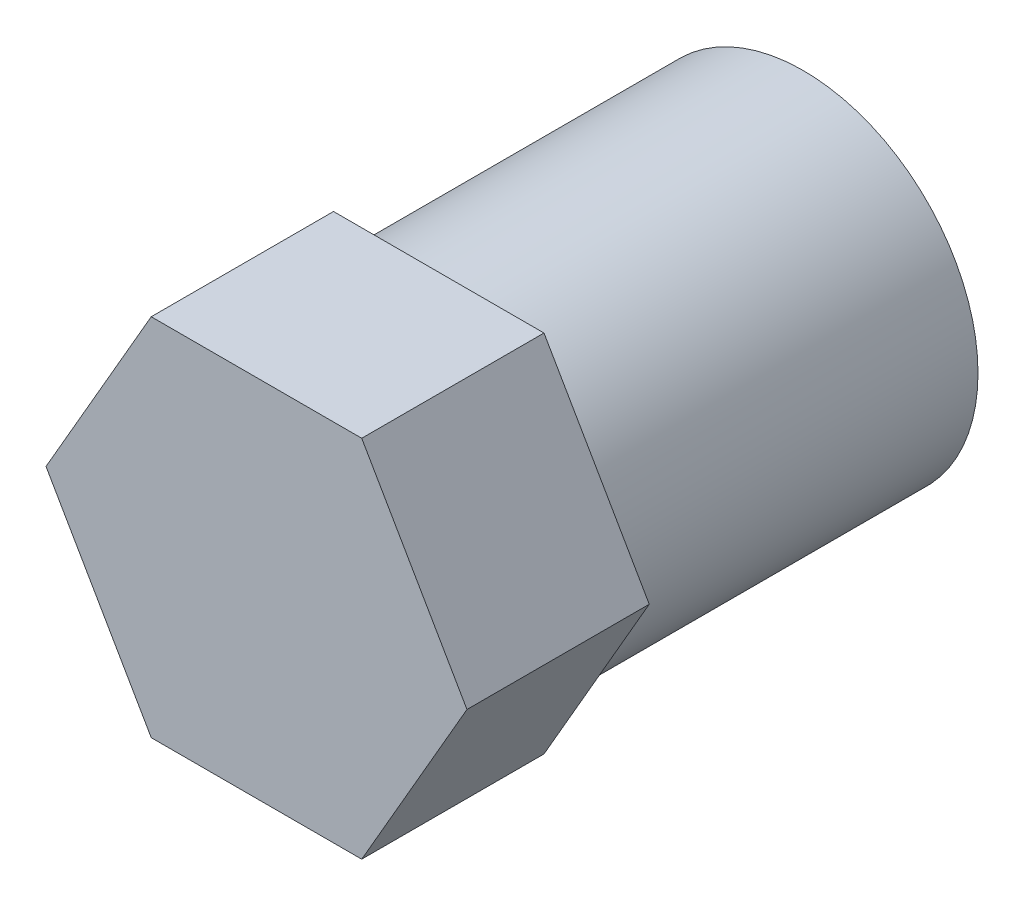
ISO-10303-21;
HEADER;
FILE_DESCRIPTION(('STEP AP214'),'2;1');
FILE_NAME('part.step','',(''),(''),'','','');
FILE_SCHEMA(('AUTOMOTIVE_DESIGN { 1 0 10303 214 1 1 1 1 }'));
ENDSEC;
DATA;
#1=APPLICATION_CONTEXT('core data for automotive mechanical design processes');
#2=APPLICATION_PROTOCOL_DEFINITION('international standard','automotive_design',2000,#1);
#3=PRODUCT_CONTEXT('',#1,'mechanical');
#4=PRODUCT('Part','Part','',(#3));
#5=PRODUCT_RELATED_PRODUCT_CATEGORY('part','',(#4));
#6=PRODUCT_DEFINITION_FORMATION('','',#4);
#7=PRODUCT_DEFINITION_CONTEXT('part definition',#1,'design');
#8=PRODUCT_DEFINITION('design','',#6,#7);
#9=PRODUCT_DEFINITION_SHAPE('','',#8);
#10=(LENGTH_UNIT() NAMED_UNIT(*) SI_UNIT(.MILLI.,.METRE.));
#11=(NAMED_UNIT(*) PLANE_ANGLE_UNIT() SI_UNIT($,.RADIAN.));
#12=(NAMED_UNIT(*) SI_UNIT($,.STERADIAN.) SOLID_ANGLE_UNIT());
#13=UNCERTAINTY_MEASURE_WITH_UNIT(LENGTH_MEASURE(1.E-05),#10,'distance_accuracy_value','');
#14=(GEOMETRIC_REPRESENTATION_CONTEXT(3) GLOBAL_UNCERTAINTY_ASSIGNED_CONTEXT((#13)) GLOBAL_UNIT_ASSIGNED_CONTEXT((#10,
#11,#12)) REPRESENTATION_CONTEXT('',''));
#15=CARTESIAN_POINT('',(0.,0.,0.));
#16=DIRECTION('',(0.,0.,1.));
#17=DIRECTION('',(1.,0.,0.));
#18=AXIS2_PLACEMENT_3D('',#15,#16,#17);
#19=CARTESIAN_POINT('',(-5.19615242270663,2.99999999999998,6.));
#20=DIRECTION('',(0.86602540378444,-0.499999999999998,0.));
#21=DIRECTION('',(0.499999999999998,0.86602540378444,0.));
#22=AXIS2_PLACEMENT_3D('',#19,#20,#21);
#23=PLANE('',#22);
#24=DIRECTION('',(-0.499999999999998,-0.86602540378444,0.));
#25=VECTOR('',#24,1.);
#26=CARTESIAN_POINT('',(-5.19615242270663,2.99999999999998,0.));
#27=LINE('',#26,#25);
#28=CARTESIAN_POINT('',(-3.46410161513775,6.,0.));
#29=VERTEX_POINT('',#28);
#30=CARTESIAN_POINT('',(-6.92820323027548,0.,0.));
#31=VERTEX_POINT('',#30);
#32=EDGE_CURVE('E125',#29,#31,#27,.T.);
#33=ORIENTED_EDGE('',*,*,#32,.T.);
#34=DIRECTION('',(0.,0.,-1.));
#35=VECTOR('',#34,1.);
#36=CARTESIAN_POINT('',(-6.92820323027548,0.,6.));
#37=LINE('',#36,#35);
#38=CARTESIAN_POINT('',(-6.92820323027548,0.,6.));
#39=VERTEX_POINT('',#38);
#40=EDGE_CURVE('E48',#39,#31,#37,.T.);
#41=ORIENTED_EDGE('',*,*,#40,.F.);
#42=DIRECTION('',(-0.499999999999998,-0.86602540378444,0.));
#43=VECTOR('',#42,1.);
#44=CARTESIAN_POINT('',(-5.19615242270663,2.99999999999998,6.));
#45=LINE('',#44,#43);
#46=CARTESIAN_POINT('',(-3.46410161513775,6.,6.));
#47=VERTEX_POINT('',#46);
#48=EDGE_CURVE('E136',#47,#39,#45,.T.);
#49=ORIENTED_EDGE('',*,*,#48,.F.);
#50=DIRECTION('',(0.,0.,-1.));
#51=VECTOR('',#50,1.);
#52=CARTESIAN_POINT('',(-3.46410161513775,6.,6.));
#53=LINE('',#52,#51);
#54=EDGE_CURVE('E121',#47,#29,#53,.T.);
#55=ORIENTED_EDGE('',*,*,#54,.T.);
#56=EDGE_LOOP('',(#33,#41,#49,#55));
#57=FACE_BOUND('',#56,.T.);
#58=ADVANCED_FACE('F40',(#57),#23,.F.);
#59=CARTESIAN_POINT('',(-5.19615242270663,-2.99999999999998,6.));
#60=DIRECTION('',(0.86602540378444,0.499999999999997,0.));
#61=DIRECTION('',(-0.499999999999997,0.86602540378444,0.));
#62=AXIS2_PLACEMENT_3D('',#59,#60,#61);
#63=PLANE('',#62);
#64=DIRECTION('',(0.499999999999997,-0.86602540378444,0.));
#65=VECTOR('',#64,1.);
#66=CARTESIAN_POINT('',(-5.19615242270663,-2.99999999999998,0.));
#67=LINE('',#66,#65);
#68=CARTESIAN_POINT('',(-3.46410161513775,-6.,0.));
#69=VERTEX_POINT('',#68);
#70=EDGE_CURVE('E128',#31,#69,#67,.T.);
#71=ORIENTED_EDGE('',*,*,#70,.T.);
#72=DIRECTION('',(0.,0.,-1.));
#73=VECTOR('',#72,1.);
#74=CARTESIAN_POINT('',(-3.46410161513775,-6.,6.));
#75=LINE('',#74,#73);
#76=CARTESIAN_POINT('',(-3.46410161513775,-6.,6.));
#77=VERTEX_POINT('',#76);
#78=EDGE_CURVE('E140',#77,#69,#75,.T.);
#79=ORIENTED_EDGE('',*,*,#78,.F.);
#80=DIRECTION('',(0.499999999999997,-0.86602540378444,0.));
#81=VECTOR('',#80,1.);
#82=CARTESIAN_POINT('',(-5.19615242270663,-2.99999999999998,6.));
#83=LINE('',#82,#81);
#84=EDGE_CURVE('E94',#39,#77,#83,.T.);
#85=ORIENTED_EDGE('',*,*,#84,.F.);
#86=ORIENTED_EDGE('',*,*,#40,.T.);
#87=EDGE_LOOP('',(#71,#79,#85,#86));
#88=FACE_BOUND('',#87,.T.);
#89=ADVANCED_FACE('F143',(#88),#63,.F.);
#90=CARTESIAN_POINT('',(0.,-6.,6.));
#91=DIRECTION('',(0.,1.,0.));
#92=DIRECTION('',(-1.,0.,0.));
#93=AXIS2_PLACEMENT_3D('',#90,#91,#92);
#94=PLANE('',#93);
#95=DIRECTION('',(1.,0.,0.));
#96=VECTOR('',#95,1.);
#97=CARTESIAN_POINT('',(0.,-6.,0.));
#98=LINE('',#97,#96);
#99=CARTESIAN_POINT('',(3.46410161513775,-6.,0.));
#100=VERTEX_POINT('',#99);
#101=EDGE_CURVE('E131',#69,#100,#98,.T.);
#102=ORIENTED_EDGE('',*,*,#101,.T.);
#103=DIRECTION('',(0.,0.,-1.));
#104=VECTOR('',#103,1.);
#105=CARTESIAN_POINT('',(3.46410161513775,-6.,6.));
#106=LINE('',#105,#104);
#107=CARTESIAN_POINT('',(3.46410161513775,-6.,6.));
#108=VERTEX_POINT('',#107);
#109=EDGE_CURVE('E116',#108,#100,#106,.T.);
#110=ORIENTED_EDGE('',*,*,#109,.F.);
#111=DIRECTION('',(1.,0.,0.));
#112=VECTOR('',#111,1.);
#113=CARTESIAN_POINT('',(0.,-6.,6.));
#114=LINE('',#113,#112);
#115=EDGE_CURVE('E107',#77,#108,#114,.T.);
#116=ORIENTED_EDGE('',*,*,#115,.F.);
#117=ORIENTED_EDGE('',*,*,#78,.T.);
#118=EDGE_LOOP('',(#102,#110,#116,#117));
#119=FACE_BOUND('',#118,.T.);
#120=ADVANCED_FACE('F151',(#119),#94,.F.);
#121=CARTESIAN_POINT('',(5.19615242270663,-2.99999999999998,6.));
#122=DIRECTION('',(-0.86602540378444,0.499999999999998,0.));
#123=DIRECTION('',(-0.499999999999998,-0.86602540378444,0.));
#124=AXIS2_PLACEMENT_3D('',#121,#122,#123);
#125=PLANE('',#124);
#126=DIRECTION('',(0.499999999999998,0.86602540378444,0.));
#127=VECTOR('',#126,1.);
#128=CARTESIAN_POINT('',(5.19615242270663,-2.99999999999998,0.));
#129=LINE('',#128,#127);
#130=CARTESIAN_POINT('',(6.92820323027548,0.,0.));
#131=VERTEX_POINT('',#130);
#132=EDGE_CURVE('E115',#100,#131,#129,.T.);
#133=ORIENTED_EDGE('',*,*,#132,.T.);
#134=DIRECTION('',(0.,0.,-1.));
#135=VECTOR('',#134,1.);
#136=CARTESIAN_POINT('',(6.92820323027548,0.,6.));
#137=LINE('',#136,#135);
#138=CARTESIAN_POINT('',(6.92820323027548,0.,6.));
#139=VERTEX_POINT('',#138);
#140=EDGE_CURVE('E112',#139,#131,#137,.T.);
#141=ORIENTED_EDGE('',*,*,#140,.F.);
#142=DIRECTION('',(0.499999999999998,0.86602540378444,0.));
#143=VECTOR('',#142,1.);
#144=CARTESIAN_POINT('',(5.19615242270663,-2.99999999999998,6.));
#145=LINE('',#144,#143);
#146=EDGE_CURVE('E101',#108,#139,#145,.T.);
#147=ORIENTED_EDGE('',*,*,#146,.F.);
#148=ORIENTED_EDGE('',*,*,#109,.T.);
#149=EDGE_LOOP('',(#133,#141,#147,#148));
#150=FACE_BOUND('',#149,.T.);
#151=ADVANCED_FACE('F113',(#150),#125,.F.);
#152=CARTESIAN_POINT('',(5.19615242270663,2.99999999999998,6.));
#153=DIRECTION('',(-0.86602540378444,-0.499999999999998,0.));
#154=DIRECTION('',(0.499999999999998,-0.86602540378444,0.));
#155=AXIS2_PLACEMENT_3D('',#152,#153,#154);
#156=PLANE('',#155);
#157=DIRECTION('',(-0.499999999999998,0.86602540378444,0.));
#158=VECTOR('',#157,1.);
#159=CARTESIAN_POINT('',(5.19615242270663,2.99999999999998,0.));
#160=LINE('',#159,#158);
#161=CARTESIAN_POINT('',(3.46410161513775,6.,0.));
#162=VERTEX_POINT('',#161);
#163=EDGE_CURVE('E79',#131,#162,#160,.T.);
#164=ORIENTED_EDGE('',*,*,#163,.T.);
#165=DIRECTION('',(0.,0.,-1.));
#166=VECTOR('',#165,1.);
#167=CARTESIAN_POINT('',(3.46410161513775,6.,6.));
#168=LINE('',#167,#166);
#169=CARTESIAN_POINT('',(3.46410161513775,6.,6.));
#170=VERTEX_POINT('',#169);
#171=EDGE_CURVE('E117',#170,#162,#168,.T.);
#172=ORIENTED_EDGE('',*,*,#171,.F.);
#173=DIRECTION('',(-0.499999999999998,0.86602540378444,0.));
#174=VECTOR('',#173,1.);
#175=CARTESIAN_POINT('',(5.19615242270663,2.99999999999998,6.));
#176=LINE('',#175,#174);
#177=EDGE_CURVE('E105',#139,#170,#176,.T.);
#178=ORIENTED_EDGE('',*,*,#177,.F.);
#179=ORIENTED_EDGE('',*,*,#140,.T.);
#180=EDGE_LOOP('',(#164,#172,#178,#179));
#181=FACE_BOUND('',#180,.T.);
#182=ADVANCED_FACE('F119',(#181),#156,.F.);
#183=CARTESIAN_POINT('',(0.,6.,6.));
#184=DIRECTION('',(0.,-1.,0.));
#185=DIRECTION('',(1.,0.,0.));
#186=AXIS2_PLACEMENT_3D('',#183,#184,#185);
#187=PLANE('',#186);
#188=DIRECTION('',(-1.,0.,0.));
#189=VECTOR('',#188,1.);
#190=CARTESIAN_POINT('',(0.,6.,0.));
#191=LINE('',#190,#189);
#192=EDGE_CURVE('E85',#162,#29,#191,.T.);
#193=ORIENTED_EDGE('',*,*,#192,.T.);
#194=ORIENTED_EDGE('',*,*,#54,.F.);
#195=DIRECTION('',(-1.,0.,0.));
#196=VECTOR('',#195,1.);
#197=CARTESIAN_POINT('',(0.,6.,6.));
#198=LINE('',#197,#196);
#199=EDGE_CURVE('E56',#170,#47,#198,.T.);
#200=ORIENTED_EDGE('',*,*,#199,.F.);
#201=ORIENTED_EDGE('',*,*,#171,.T.);
#202=EDGE_LOOP('',(#193,#194,#200,#201));
#203=FACE_BOUND('',#202,.T.);
#204=ADVANCED_FACE('F197',(#203),#187,.F.);
#205=CARTESIAN_POINT('',(0.,0.,6.));
#206=DIRECTION('',(0.,0.,1.));
#207=DIRECTION('',(1.,0.,0.));
#208=AXIS2_PLACEMENT_3D('',#205,#206,#207);
#209=PLANE('',#208);
#210=ORIENTED_EDGE('',*,*,#48,.T.);
#211=ORIENTED_EDGE('',*,*,#84,.T.);
#212=ORIENTED_EDGE('',*,*,#115,.T.);
#213=ORIENTED_EDGE('',*,*,#146,.T.);
#214=ORIENTED_EDGE('',*,*,#177,.T.);
#215=ORIENTED_EDGE('',*,*,#199,.T.);
#216=EDGE_LOOP('',(#210,#211,#212,#213,#214,#215));
#217=FACE_BOUND('',#216,.T.);
#218=ADVANCED_FACE('F103',(#217),#209,.T.);
#219=CARTESIAN_POINT('',(0.,0.,0.));
#220=DIRECTION('',(0.,0.,1.));
#221=DIRECTION('',(1.,0.,0.));
#222=AXIS2_PLACEMENT_3D('',#219,#220,#221);
#223=PLANE('',#222);
#224=CARTESIAN_POINT('',(0.,0.,0.));
#225=DIRECTION('',(0.,0.,1.));
#226=DIRECTION('',(1.,0.,0.));
#227=AXIS2_PLACEMENT_3D('',#224,#225,#226);
#228=CIRCLE('',#227,5.75);
#229=CARTESIAN_POINT('',(5.75,0.,0.));
#230=VERTEX_POINT('',#229);
#231=EDGE_CURVE('E155',#230,#230,#228,.T.);
#232=ORIENTED_EDGE('',*,*,#231,.T.);
#233=EDGE_LOOP('',(#232));
#234=FACE_BOUND('',#233,.T.);
#235=ORIENTED_EDGE('',*,*,#32,.F.);
#236=ORIENTED_EDGE('',*,*,#192,.F.);
#237=ORIENTED_EDGE('',*,*,#163,.F.);
#238=ORIENTED_EDGE('',*,*,#132,.F.);
#239=ORIENTED_EDGE('',*,*,#101,.F.);
#240=ORIENTED_EDGE('',*,*,#70,.F.);
#241=EDGE_LOOP('',(#235,#236,#237,#238,#239,#240));
#242=FACE_BOUND('',#241,.T.);
#243=ADVANCED_FACE('F148',(#234,#242),#223,.F.);
#244=CARTESIAN_POINT('',(0.,0.,-12.));
#245=DIRECTION('',(0.,0.,1.));
#246=DIRECTION('',(1.,0.,0.));
#247=AXIS2_PLACEMENT_3D('',#244,#245,#246);
#248=CYLINDRICAL_SURFACE('',#247,3.);
#249=CARTESIAN_POINT('',(0.,0.,-12.));
#250=DIRECTION('',(0.,0.,1.));
#251=DIRECTION('',(1.,0.,0.));
#252=AXIS2_PLACEMENT_3D('',#249,#250,#251);
#253=CIRCLE('',#252,3.);
#254=CARTESIAN_POINT('',(3.,0.,-12.));
#255=VERTEX_POINT('',#254);
#256=EDGE_CURVE('E158',#255,#255,#253,.T.);
#257=ORIENTED_EDGE('',*,*,#256,.F.);
#258=EDGE_LOOP('',(#257));
#259=FACE_BOUND('',#258,.T.);
#260=CARTESIAN_POINT('',(0.,0.,0.));
#261=DIRECTION('',(0.,0.,1.));
#262=DIRECTION('',(1.,0.,0.));
#263=AXIS2_PLACEMENT_3D('',#260,#261,#262);
#264=CIRCLE('',#263,3.);
#265=CARTESIAN_POINT('',(3.,0.,0.));
#266=VERTEX_POINT('',#265);
#267=EDGE_CURVE('E11',#266,#266,#264,.T.);
#268=ORIENTED_EDGE('',*,*,#267,.T.);
#269=EDGE_LOOP('',(#268));
#270=FACE_BOUND('',#269,.T.);
#271=ADVANCED_FACE('F167',(#259,#270),#248,.F.);
#272=CARTESIAN_POINT('',(0.,0.,-12.));
#273=DIRECTION('',(0.,0.,1.));
#274=DIRECTION('',(1.,0.,0.));
#275=AXIS2_PLACEMENT_3D('',#272,#273,#274);
#276=CYLINDRICAL_SURFACE('',#275,5.75);
#277=CARTESIAN_POINT('',(0.,0.,-12.));
#278=DIRECTION('',(0.,0.,1.));
#279=DIRECTION('',(1.,0.,0.));
#280=AXIS2_PLACEMENT_3D('',#277,#278,#279);
#281=CIRCLE('',#280,5.75);
#282=CARTESIAN_POINT('',(5.75,0.,-12.));
#283=VERTEX_POINT('',#282);
#284=EDGE_CURVE('E129',#283,#283,#281,.T.);
#285=ORIENTED_EDGE('',*,*,#284,.T.);
#286=EDGE_LOOP('',(#285));
#287=FACE_BOUND('',#286,.T.);
#288=ORIENTED_EDGE('',*,*,#231,.F.);
#289=EDGE_LOOP('',(#288));
#290=FACE_BOUND('',#289,.T.);
#291=ADVANCED_FACE('F170',(#287,#290),#276,.T.);
#292=CARTESIAN_POINT('',(0.,0.,-12.));
#293=DIRECTION('',(0.,0.,1.));
#294=DIRECTION('',(1.,0.,0.));
#295=AXIS2_PLACEMENT_3D('',#292,#293,#294);
#296=PLANE('',#295);
#297=ORIENTED_EDGE('',*,*,#256,.T.);
#298=EDGE_LOOP('',(#297));
#299=FACE_BOUND('',#298,.T.);
#300=ORIENTED_EDGE('',*,*,#284,.F.);
#301=EDGE_LOOP('',(#300));
#302=FACE_BOUND('',#301,.T.);
#303=ADVANCED_FACE('F164',(#299,#302),#296,.F.);
#304=ORIENTED_EDGE('',*,*,#267,.F.);
#305=EDGE_LOOP('',(#304));
#306=FACE_BOUND('',#305,.T.);
#307=ADVANCED_FACE('F174',(#306),#223,.F.);
#308=CLOSED_SHELL('',(#58,#89,#120,#151,#182,#204,#218,#243,#271,#291,#303,#307));
#309=MANIFOLD_SOLID_BREP('B2',#308);
#310=ADVANCED_BREP_SHAPE_REPRESENTATION('',(#18,#309),#14);
#311=SHAPE_DEFINITION_REPRESENTATION(#9,#310);
ENDSEC;
END-ISO-10303-21;
